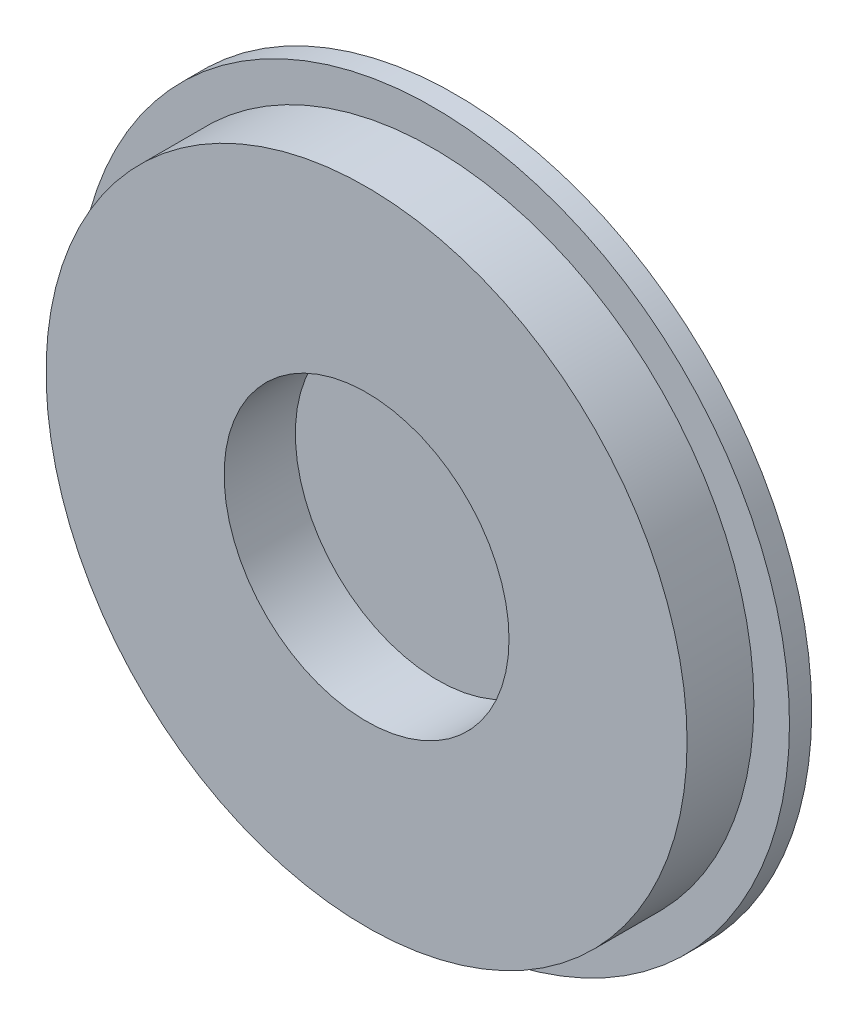
ISO-10303-21;
HEADER;
FILE_DESCRIPTION(('STEP AP214'),'2;1');
FILE_NAME('part.step','',(''),(''),'','','');
FILE_SCHEMA(('AUTOMOTIVE_DESIGN { 1 0 10303 214 1 1 1 1 }'));
ENDSEC;
DATA;
#1=APPLICATION_CONTEXT('core data for automotive mechanical design processes');
#2=APPLICATION_PROTOCOL_DEFINITION('international standard','automotive_design',2000,#1);
#3=PRODUCT_CONTEXT('',#1,'mechanical');
#4=PRODUCT('Part','Part','',(#3));
#5=PRODUCT_RELATED_PRODUCT_CATEGORY('part','',(#4));
#6=PRODUCT_DEFINITION_FORMATION('','',#4);
#7=PRODUCT_DEFINITION_CONTEXT('part definition',#1,'design');
#8=PRODUCT_DEFINITION('design','',#6,#7);
#9=PRODUCT_DEFINITION_SHAPE('','',#8);
#10=(LENGTH_UNIT() NAMED_UNIT(*) SI_UNIT(.MILLI.,.METRE.));
#11=(NAMED_UNIT(*) PLANE_ANGLE_UNIT() SI_UNIT($,.RADIAN.));
#12=(NAMED_UNIT(*) SI_UNIT($,.STERADIAN.) SOLID_ANGLE_UNIT());
#13=UNCERTAINTY_MEASURE_WITH_UNIT(LENGTH_MEASURE(1.E-05),#10,'distance_accuracy_value','');
#14=(GEOMETRIC_REPRESENTATION_CONTEXT(3) GLOBAL_UNCERTAINTY_ASSIGNED_CONTEXT((#13)) GLOBAL_UNIT_ASSIGNED_CONTEXT((#10,
#11,#12)) REPRESENTATION_CONTEXT('',''));
#15=CARTESIAN_POINT('',(0.,0.,0.));
#16=DIRECTION('',(0.,0.,1.));
#17=DIRECTION('',(1.,0.,0.));
#18=AXIS2_PLACEMENT_3D('',#15,#16,#17);
#19=CARTESIAN_POINT('',(0.,0.,1.25));
#20=DIRECTION('',(0.,0.,1.));
#21=DIRECTION('',(1.,0.,0.));
#22=AXIS2_PLACEMENT_3D('',#19,#20,#21);
#23=PLANE('',#22);
#24=CARTESIAN_POINT('',(0.,0.,1.25));
#25=DIRECTION('',(0.,0.,1.));
#26=DIRECTION('',(1.,0.,0.));
#27=AXIS2_PLACEMENT_3D('',#24,#25,#26);
#28=CIRCLE('',#27,20.);
#29=CARTESIAN_POINT('',(20.,0.,1.25));
#30=VERTEX_POINT('',#29);
#31=EDGE_CURVE('E10',#30,#30,#28,.T.);
#32=ORIENTED_EDGE('',*,*,#31,.T.);
#33=EDGE_LOOP('',(#32));
#34=FACE_BOUND('',#33,.T.);
#35=CARTESIAN_POINT('',(0.,0.,1.25));
#36=DIRECTION('',(0.,0.,1.));
#37=DIRECTION('',(1.,0.,0.));
#38=AXIS2_PLACEMENT_3D('',#35,#36,#37);
#39=CIRCLE('',#38,18.);
#40=CARTESIAN_POINT('',(18.,0.,1.25));
#41=VERTEX_POINT('',#40);
#42=EDGE_CURVE('E50',#41,#41,#39,.T.);
#43=ORIENTED_EDGE('',*,*,#42,.F.);
#44=EDGE_LOOP('',(#43));
#45=FACE_BOUND('',#44,.T.);
#46=ADVANCED_FACE('F37',(#34,#45),#23,.T.);
#47=CARTESIAN_POINT('',(0.,0.,1.25));
#48=DIRECTION('',(0.,0.,-1.));
#49=DIRECTION('',(-1.,0.,0.));
#50=AXIS2_PLACEMENT_3D('',#47,#48,#49);
#51=CYLINDRICAL_SURFACE('',#50,20.);
#52=ORIENTED_EDGE('',*,*,#31,.F.);
#53=EDGE_LOOP('',(#52));
#54=FACE_BOUND('',#53,.T.);
#55=CARTESIAN_POINT('',(0.,0.,0.));
#56=DIRECTION('',(0.,0.,1.));
#57=DIRECTION('',(1.,0.,0.));
#58=AXIS2_PLACEMENT_3D('',#55,#56,#57);
#59=CIRCLE('',#58,20.);
#60=CARTESIAN_POINT('',(20.,0.,0.));
#61=VERTEX_POINT('',#60);
#62=EDGE_CURVE('E41',#61,#61,#59,.T.);
#63=ORIENTED_EDGE('',*,*,#62,.T.);
#64=EDGE_LOOP('',(#63));
#65=FACE_BOUND('',#64,.T.);
#66=ADVANCED_FACE('F39',(#54,#65),#51,.T.);
#67=CARTESIAN_POINT('',(0.,0.,0.));
#68=DIRECTION('',(0.,0.,1.));
#69=DIRECTION('',(1.,0.,0.));
#70=AXIS2_PLACEMENT_3D('',#67,#68,#69);
#71=PLANE('',#70);
#72=ORIENTED_EDGE('',*,*,#62,.F.);
#73=EDGE_LOOP('',(#72));
#74=FACE_BOUND('',#73,.T.);
#75=ADVANCED_FACE('F79',(#74),#71,.F.);
#76=CARTESIAN_POINT('',(0.,0.,5.));
#77=DIRECTION('',(0.,0.,-1.));
#78=DIRECTION('',(-1.,0.,0.));
#79=AXIS2_PLACEMENT_3D('',#76,#77,#78);
#80=CYLINDRICAL_SURFACE('',#79,18.);
#81=CARTESIAN_POINT('',(0.,0.,5.));
#82=DIRECTION('',(0.,0.,1.));
#83=DIRECTION('',(1.,0.,0.));
#84=AXIS2_PLACEMENT_3D('',#81,#82,#83);
#85=CIRCLE('',#84,18.);
#86=CARTESIAN_POINT('',(18.,0.,5.));
#87=VERTEX_POINT('',#86);
#88=EDGE_CURVE('E48',#87,#87,#85,.T.);
#89=ORIENTED_EDGE('',*,*,#88,.F.);
#90=EDGE_LOOP('',(#89));
#91=FACE_BOUND('',#90,.T.);
#92=ORIENTED_EDGE('',*,*,#42,.T.);
#93=EDGE_LOOP('',(#92));
#94=FACE_BOUND('',#93,.T.);
#95=ADVANCED_FACE('F73',(#91,#94),#80,.T.);
#96=CARTESIAN_POINT('',(0.,0.,5.));
#97=DIRECTION('',(0.,0.,1.));
#98=DIRECTION('',(1.,0.,0.));
#99=AXIS2_PLACEMENT_3D('',#96,#97,#98);
#100=PLANE('',#99);
#101=CARTESIAN_POINT('',(0.,0.,5.));
#102=DIRECTION('',(0.,0.,1.));
#103=DIRECTION('',(1.,0.,0.));
#104=AXIS2_PLACEMENT_3D('',#101,#102,#103);
#105=CIRCLE('',#104,8.);
#106=CARTESIAN_POINT('',(8.,0.,5.));
#107=VERTEX_POINT('',#106);
#108=EDGE_CURVE('E56',#107,#107,#105,.T.);
#109=ORIENTED_EDGE('',*,*,#108,.F.);
#110=EDGE_LOOP('',(#109));
#111=FACE_BOUND('',#110,.T.);
#112=ORIENTED_EDGE('',*,*,#88,.T.);
#113=EDGE_LOOP('',(#112));
#114=FACE_BOUND('',#113,.T.);
#115=ADVANCED_FACE('F67',(#111,#114),#100,.T.);
#116=CARTESIAN_POINT('',(0.,0.,1.));
#117=DIRECTION('',(0.,0.,1.));
#118=DIRECTION('',(1.,0.,0.));
#119=AXIS2_PLACEMENT_3D('',#116,#117,#118);
#120=CYLINDRICAL_SURFACE('',#119,8.);
#121=CARTESIAN_POINT('',(0.,0.,1.));
#122=DIRECTION('',(0.,0.,1.));
#123=DIRECTION('',(1.,0.,0.));
#124=AXIS2_PLACEMENT_3D('',#121,#122,#123);
#125=CIRCLE('',#124,8.);
#126=CARTESIAN_POINT('',(8.,0.,1.));
#127=VERTEX_POINT('',#126);
#128=EDGE_CURVE('E53',#127,#127,#125,.T.);
#129=ORIENTED_EDGE('',*,*,#128,.F.);
#130=EDGE_LOOP('',(#129));
#131=FACE_BOUND('',#130,.T.);
#132=ORIENTED_EDGE('',*,*,#108,.T.);
#133=EDGE_LOOP('',(#132));
#134=FACE_BOUND('',#133,.T.);
#135=ADVANCED_FACE('F64',(#131,#134),#120,.F.);
#136=CARTESIAN_POINT('',(0.,0.,1.));
#137=DIRECTION('',(0.,0.,1.));
#138=DIRECTION('',(1.,0.,0.));
#139=AXIS2_PLACEMENT_3D('',#136,#137,#138);
#140=PLANE('',#139);
#141=ORIENTED_EDGE('',*,*,#128,.T.);
#142=EDGE_LOOP('',(#141));
#143=FACE_BOUND('',#142,.T.);
#144=ADVANCED_FACE('F62',(#143),#140,.T.);
#145=CLOSED_SHELL('',(#46,#66,#75,#95,#115,#135,#144));
#146=MANIFOLD_SOLID_BREP('B2',#145);
#147=ADVANCED_BREP_SHAPE_REPRESENTATION('',(#18,#146),#14);
#148=SHAPE_DEFINITION_REPRESENTATION(#9,#147);
ENDSEC;
END-ISO-10303-21;
